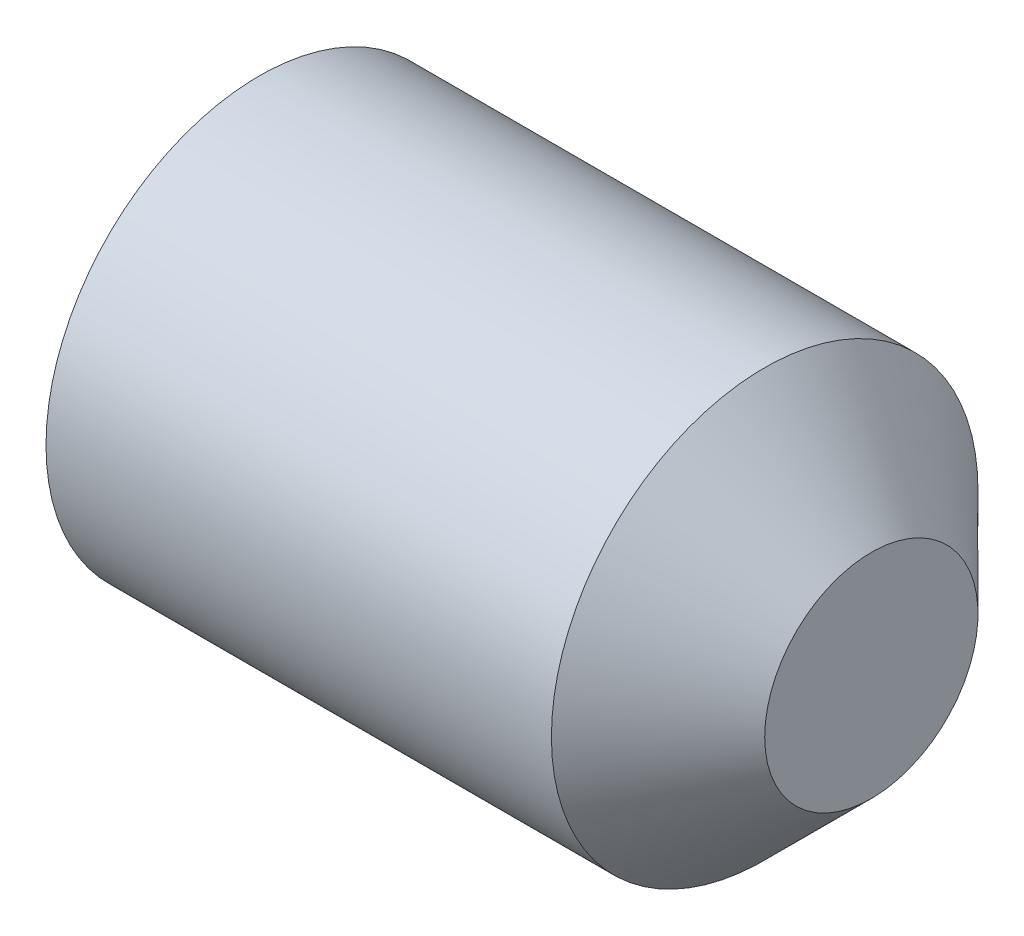
ISO-10303-21;
HEADER;
FILE_DESCRIPTION(('STEP AP214'),'2;1');
FILE_NAME('part.step','',(''),(''),'','','');
FILE_SCHEMA(('AUTOMOTIVE_DESIGN { 1 0 10303 214 1 1 1 1 }'));
ENDSEC;
DATA;
#1=APPLICATION_CONTEXT('core data for automotive mechanical design processes');
#2=APPLICATION_PROTOCOL_DEFINITION('international standard','automotive_design',2000,#1);
#3=PRODUCT_CONTEXT('',#1,'mechanical');
#4=PRODUCT('Part','Part','',(#3));
#5=PRODUCT_RELATED_PRODUCT_CATEGORY('part','',(#4));
#6=PRODUCT_DEFINITION_FORMATION('','',#4);
#7=PRODUCT_DEFINITION_CONTEXT('part definition',#1,'design');
#8=PRODUCT_DEFINITION('design','',#6,#7);
#9=PRODUCT_DEFINITION_SHAPE('','',#8);
#10=(LENGTH_UNIT() NAMED_UNIT(*) SI_UNIT(.MILLI.,.METRE.));
#11=(NAMED_UNIT(*) PLANE_ANGLE_UNIT() SI_UNIT($,.RADIAN.));
#12=(NAMED_UNIT(*) SI_UNIT($,.STERADIAN.) SOLID_ANGLE_UNIT());
#13=UNCERTAINTY_MEASURE_WITH_UNIT(LENGTH_MEASURE(1.E-05),#10,'distance_accuracy_value','');
#14=(GEOMETRIC_REPRESENTATION_CONTEXT(3) GLOBAL_UNCERTAINTY_ASSIGNED_CONTEXT((#13)) GLOBAL_UNIT_ASSIGNED_CONTEXT((#10,
#11,#12)) REPRESENTATION_CONTEXT('',''));
#15=CARTESIAN_POINT('',(0.,0.,0.));
#16=DIRECTION('',(0.,0.,1.));
#17=DIRECTION('',(1.,0.,0.));
#18=AXIS2_PLACEMENT_3D('',#15,#16,#17);
#19=CARTESIAN_POINT('',(0.,0.,0.));
#20=DIRECTION('',(-1.,0.,0.));
#21=DIRECTION('',(0.,0.,1.));
#22=AXIS2_PLACEMENT_3D('',#19,#20,#21);
#23=PLANE('',#22);
#24=CARTESIAN_POINT('',(0.,0.,0.));
#25=DIRECTION('',(-1.,0.,0.));
#26=DIRECTION('',(0.,0.,1.));
#27=AXIS2_PLACEMENT_3D('',#24,#25,#26);
#28=CIRCLE('',#27,0.774000000000001);
#29=CARTESIAN_POINT('',(0.,0.,0.774000000000001));
#30=VERTEX_POINT('',#29);
#31=EDGE_CURVE('E138',#30,#30,#28,.T.);
#32=ORIENTED_EDGE('',*,*,#31,.T.);
#33=EDGE_LOOP('',(#32));
#34=FACE_BOUND('',#33,.T.);
#35=DIRECTION('',(0.,0.,-1.));
#36=VECTOR('',#35,1.);
#37=CARTESIAN_POINT('',(0.,0.450000000000003,0.25980762113533));
#38=LINE('',#37,#36);
#39=CARTESIAN_POINT('',(0.,0.450000000000003,0.25980762113533));
#40=VERTEX_POINT('',#39);
#41=CARTESIAN_POINT('',(0.,0.450000000000003,-0.259807621135334));
#42=VERTEX_POINT('',#41);
#43=EDGE_CURVE('E129',#40,#42,#38,.T.);
#44=ORIENTED_EDGE('',*,*,#43,.F.);
#45=DIRECTION('',(0.,-0.866025403784439,0.5));
#46=VECTOR('',#45,1.);
#47=CARTESIAN_POINT('',(0.,0.450000000000003,0.25980762113533));
#48=LINE('',#47,#46);
#49=CARTESIAN_POINT('',(0.,0.,0.519615242270661));
#50=VERTEX_POINT('',#49);
#51=EDGE_CURVE('E51',#40,#50,#48,.T.);
#52=ORIENTED_EDGE('',*,*,#51,.T.);
#53=DIRECTION('',(0.,0.866025403784439,0.5));
#54=VECTOR('',#53,1.);
#55=CARTESIAN_POINT('',(0.,-0.449999999999997,0.259807621135329));
#56=LINE('',#55,#54);
#57=CARTESIAN_POINT('',(0.,-0.449999999999997,0.259807621135329));
#58=VERTEX_POINT('',#57);
#59=EDGE_CURVE('E120',#58,#50,#56,.T.);
#60=ORIENTED_EDGE('',*,*,#59,.F.);
#61=DIRECTION('',(0.,0.,-1.));
#62=VECTOR('',#61,1.);
#63=CARTESIAN_POINT('',(0.,-0.449999999999997,0.259807621135329));
#64=LINE('',#63,#62);
#65=CARTESIAN_POINT('',(0.,-0.449999999999997,-0.259807621135334));
#66=VERTEX_POINT('',#65);
#67=EDGE_CURVE('E123',#58,#66,#64,.T.);
#68=ORIENTED_EDGE('',*,*,#67,.T.);
#69=DIRECTION('',(0.,0.866025403784439,-0.5));
#70=VECTOR('',#69,1.);
#71=CARTESIAN_POINT('',(0.,-0.449999999999997,-0.259807621135334));
#72=LINE('',#71,#70);
#73=CARTESIAN_POINT('',(0.,0.,-0.519615242270665));
#74=VERTEX_POINT('',#73);
#75=EDGE_CURVE('E126',#66,#74,#72,.T.);
#76=ORIENTED_EDGE('',*,*,#75,.T.);
#77=DIRECTION('',(0.,-0.866025403784438,-0.5));
#78=VECTOR('',#77,1.);
#79=CARTESIAN_POINT('',(0.,0.450000000000003,-0.259807621135334));
#80=LINE('',#79,#78);
#81=EDGE_CURVE('E109',#42,#74,#80,.T.);
#82=ORIENTED_EDGE('',*,*,#81,.F.);
#83=EDGE_LOOP('',(#44,#52,#60,#68,#76,#82));
#84=FACE_BOUND('',#83,.T.);
#85=ADVANCED_FACE('F36',(#34,#84),#23,.T.);
#86=CARTESIAN_POINT('',(3.,0.5,0.));
#87=DIRECTION('',(1.,0.,0.));
#88=DIRECTION('',(0.,0.,-1.));
#89=AXIS2_PLACEMENT_3D('',#86,#87,#88);
#90=PLANE('',#89);
#91=CARTESIAN_POINT('',(3.,0.,0.));
#92=DIRECTION('',(-1.,0.,0.));
#93=DIRECTION('',(0.,0.,1.));
#94=AXIS2_PLACEMENT_3D('',#91,#92,#93);
#95=CIRCLE('',#94,0.5);
#96=CARTESIAN_POINT('',(3.,0.,0.5));
#97=VERTEX_POINT('',#96);
#98=EDGE_CURVE('E11',#97,#97,#95,.T.);
#99=ORIENTED_EDGE('',*,*,#98,.F.);
#100=EDGE_LOOP('',(#99));
#101=FACE_BOUND('',#100,.T.);
#102=ADVANCED_FACE('F38',(#101),#90,.T.);
#103=CARTESIAN_POINT('',(2.50000000000001,0.,0.));
#104=DIRECTION('',(-1.,0.,0.));
#105=DIRECTION('',(0.,0.,1.));
#106=AXIS2_PLACEMENT_3D('',#103,#104,#105);
#107=CONICAL_SURFACE('',#106,1.,0.785398163397455);
#108=ORIENTED_EDGE('',*,*,#98,.T.);
#109=EDGE_LOOP('',(#108));
#110=FACE_BOUND('',#109,.T.);
#111=CARTESIAN_POINT('',(2.50000000000001,0.,0.));
#112=DIRECTION('',(-1.,0.,0.));
#113=DIRECTION('',(0.,0.,1.));
#114=AXIS2_PLACEMENT_3D('',#111,#112,#113);
#115=CIRCLE('',#114,1.);
#116=CARTESIAN_POINT('',(2.50000000000001,0.,1.));
#117=VERTEX_POINT('',#116);
#118=EDGE_CURVE('E44',#117,#117,#115,.T.);
#119=ORIENTED_EDGE('',*,*,#118,.F.);
#120=EDGE_LOOP('',(#119));
#121=FACE_BOUND('',#120,.T.);
#122=ADVANCED_FACE('F149',(#110,#121),#107,.T.);
#123=CARTESIAN_POINT('',(-12.7,0.,0.));
#124=DIRECTION('',(-1.,0.,0.));
#125=DIRECTION('',(0.,0.,1.));
#126=AXIS2_PLACEMENT_3D('',#123,#124,#125);
#127=CYLINDRICAL_SURFACE('',#126,1.);
#128=ORIENTED_EDGE('',*,*,#118,.T.);
#129=EDGE_LOOP('',(#128));
#130=FACE_BOUND('',#129,.T.);
#131=CARTESIAN_POINT('',(0.130481160836854,0.,0.));
#132=DIRECTION('',(-1.,0.,0.));
#133=DIRECTION('',(0.,0.,1.));
#134=AXIS2_PLACEMENT_3D('',#131,#132,#133);
#135=CIRCLE('',#134,1.);
#136=CARTESIAN_POINT('',(0.130481160836854,0.,1.));
#137=VERTEX_POINT('',#136);
#138=EDGE_CURVE('E141',#137,#137,#135,.T.);
#139=ORIENTED_EDGE('',*,*,#138,.F.);
#140=EDGE_LOOP('',(#139));
#141=FACE_BOUND('',#140,.T.);
#142=ADVANCED_FACE('F146',(#130,#141),#127,.T.);
#143=CARTESIAN_POINT('',(0.,0.,0.));
#144=DIRECTION('',(1.,0.,0.));
#145=DIRECTION('',(0.,0.,-1.));
#146=AXIS2_PLACEMENT_3D('',#143,#144,#145);
#147=CONICAL_SURFACE('',#146,0.774000000000001,1.0471975511966);
#148=ORIENTED_EDGE('',*,*,#138,.T.);
#149=EDGE_LOOP('',(#148));
#150=FACE_BOUND('',#149,.T.);
#151=ORIENTED_EDGE('',*,*,#31,.F.);
#152=EDGE_LOOP('',(#151));
#153=FACE_BOUND('',#152,.T.);
#154=ADVANCED_FACE('F156',(#150,#153),#147,.T.);
#155=CARTESIAN_POINT('',(0.8,0.450000000000003,0.25980762113533));
#156=DIRECTION('',(0.,-0.5,-0.866025403784439));
#157=DIRECTION('',(0.,0.866025403784439,-0.5));
#158=AXIS2_PLACEMENT_3D('',#155,#156,#157);
#159=PLANE('',#158);
#160=ORIENTED_EDGE('',*,*,#51,.F.);
#161=DIRECTION('',(-1.,0.,0.));
#162=VECTOR('',#161,1.);
#163=CARTESIAN_POINT('',(0.8,0.450000000000003,0.25980762113533));
#164=LINE('',#163,#162);
#165=CARTESIAN_POINT('',(0.8,0.450000000000003,0.25980762113533));
#166=VERTEX_POINT('',#165);
#167=EDGE_CURVE('E56',#166,#40,#164,.T.);
#168=ORIENTED_EDGE('',*,*,#167,.F.);
#169=DIRECTION('',(0.,-0.866025403784439,0.5));
#170=VECTOR('',#169,1.);
#171=CARTESIAN_POINT('',(0.8,0.450000000000003,0.25980762113533));
#172=LINE('',#171,#170);
#173=CARTESIAN_POINT('',(0.8,0.,0.519615242270661));
#174=VERTEX_POINT('',#173);
#175=EDGE_CURVE('E83',#166,#174,#172,.T.);
#176=ORIENTED_EDGE('',*,*,#175,.T.);
#177=DIRECTION('',(-1.,0.,0.));
#178=VECTOR('',#177,1.);
#179=CARTESIAN_POINT('',(0.8,0.,0.519615242270661));
#180=LINE('',#179,#178);
#181=EDGE_CURVE('E136',#174,#50,#180,.T.);
#182=ORIENTED_EDGE('',*,*,#181,.T.);
#183=EDGE_LOOP('',(#160,#168,#176,#182));
#184=FACE_BOUND('',#183,.T.);
#185=ADVANCED_FACE('F167',(#184),#159,.T.);
#186=CARTESIAN_POINT('',(0.8,-0.449999999999997,0.259807621135329));
#187=DIRECTION('',(0.,-0.5,0.866025403784439));
#188=DIRECTION('',(0.,-0.866025403784439,-0.5));
#189=AXIS2_PLACEMENT_3D('',#186,#187,#188);
#190=PLANE('',#189);
#191=ORIENTED_EDGE('',*,*,#59,.T.);
#192=ORIENTED_EDGE('',*,*,#181,.F.);
#193=DIRECTION('',(0.,0.866025403784439,0.5));
#194=VECTOR('',#193,1.);
#195=CARTESIAN_POINT('',(0.8,-0.449999999999997,0.259807621135329));
#196=LINE('',#195,#194);
#197=CARTESIAN_POINT('',(0.8,-0.449999999999997,0.259807621135329));
#198=VERTEX_POINT('',#197);
#199=EDGE_CURVE('E267',#198,#174,#196,.T.);
#200=ORIENTED_EDGE('',*,*,#199,.F.);
#201=DIRECTION('',(-1.,0.,0.));
#202=VECTOR('',#201,1.);
#203=CARTESIAN_POINT('',(0.8,-0.449999999999997,0.259807621135329));
#204=LINE('',#203,#202);
#205=EDGE_CURVE('E134',#198,#58,#204,.T.);
#206=ORIENTED_EDGE('',*,*,#205,.T.);
#207=EDGE_LOOP('',(#191,#192,#200,#206));
#208=FACE_BOUND('',#207,.T.);
#209=ADVANCED_FACE('F174',(#208),#190,.F.);
#210=CARTESIAN_POINT('',(0.8,-0.449999999999997,0.259807621135329));
#211=DIRECTION('',(0.,1.,0.));
#212=DIRECTION('',(0.,0.,1.));
#213=AXIS2_PLACEMENT_3D('',#210,#211,#212);
#214=PLANE('',#213);
#215=ORIENTED_EDGE('',*,*,#67,.F.);
#216=ORIENTED_EDGE('',*,*,#205,.F.);
#217=DIRECTION('',(0.,0.,-1.));
#218=VECTOR('',#217,1.);
#219=CARTESIAN_POINT('',(0.8,-0.449999999999997,0.259807621135329));
#220=LINE('',#219,#218);
#221=CARTESIAN_POINT('',(0.8,-0.449999999999997,-0.259807621135334));
#222=VERTEX_POINT('',#221);
#223=EDGE_CURVE('E104',#198,#222,#220,.T.);
#224=ORIENTED_EDGE('',*,*,#223,.T.);
#225=DIRECTION('',(-1.,0.,0.));
#226=VECTOR('',#225,1.);
#227=CARTESIAN_POINT('',(0.8,-0.449999999999997,-0.259807621135334));
#228=LINE('',#227,#226);
#229=EDGE_CURVE('E99',#222,#66,#228,.T.);
#230=ORIENTED_EDGE('',*,*,#229,.T.);
#231=EDGE_LOOP('',(#215,#216,#224,#230));
#232=FACE_BOUND('',#231,.T.);
#233=ADVANCED_FACE('F181',(#232),#214,.T.);
#234=CARTESIAN_POINT('',(0.8,-0.449999999999997,-0.259807621135334));
#235=DIRECTION('',(0.,0.5,0.866025403784439));
#236=DIRECTION('',(0.,-0.866025403784439,0.5));
#237=AXIS2_PLACEMENT_3D('',#234,#235,#236);
#238=PLANE('',#237);
#239=ORIENTED_EDGE('',*,*,#75,.F.);
#240=ORIENTED_EDGE('',*,*,#229,.F.);
#241=DIRECTION('',(0.,0.866025403784439,-0.5));
#242=VECTOR('',#241,1.);
#243=CARTESIAN_POINT('',(0.8,-0.449999999999997,-0.259807621135334));
#244=LINE('',#243,#242);
#245=CARTESIAN_POINT('',(0.8,0.,-0.519615242270665));
#246=VERTEX_POINT('',#245);
#247=EDGE_CURVE('E94',#222,#246,#244,.T.);
#248=ORIENTED_EDGE('',*,*,#247,.T.);
#249=DIRECTION('',(-1.,0.,0.));
#250=VECTOR('',#249,1.);
#251=CARTESIAN_POINT('',(0.8,0.,-0.519615242270665));
#252=LINE('',#251,#250);
#253=EDGE_CURVE('E98',#246,#74,#252,.T.);
#254=ORIENTED_EDGE('',*,*,#253,.T.);
#255=EDGE_LOOP('',(#239,#240,#248,#254));
#256=FACE_BOUND('',#255,.T.);
#257=ADVANCED_FACE('F97',(#256),#238,.T.);
#258=CARTESIAN_POINT('',(0.8,0.450000000000003,-0.259807621135334));
#259=DIRECTION('',(0.,0.5,-0.866025403784438));
#260=DIRECTION('',(0.,0.866025403784439,0.5));
#261=AXIS2_PLACEMENT_3D('',#258,#259,#260);
#262=PLANE('',#261);
#263=ORIENTED_EDGE('',*,*,#81,.T.);
#264=ORIENTED_EDGE('',*,*,#253,.F.);
#265=DIRECTION('',(0.,-0.866025403784438,-0.5));
#266=VECTOR('',#265,1.);
#267=CARTESIAN_POINT('',(0.8,0.450000000000003,-0.259807621135334));
#268=LINE('',#267,#266);
#269=CARTESIAN_POINT('',(0.8,0.450000000000003,-0.259807621135334));
#270=VERTEX_POINT('',#269);
#271=EDGE_CURVE('E103',#270,#246,#268,.T.);
#272=ORIENTED_EDGE('',*,*,#271,.F.);
#273=DIRECTION('',(-1.,0.,0.));
#274=VECTOR('',#273,1.);
#275=CARTESIAN_POINT('',(0.8,0.450000000000003,-0.259807621135334));
#276=LINE('',#275,#274);
#277=EDGE_CURVE('E79',#270,#42,#276,.T.);
#278=ORIENTED_EDGE('',*,*,#277,.T.);
#279=EDGE_LOOP('',(#263,#264,#272,#278));
#280=FACE_BOUND('',#279,.T.);
#281=ADVANCED_FACE('F106',(#280),#262,.F.);
#282=CARTESIAN_POINT('',(0.8,0.450000000000003,0.25980762113533));
#283=DIRECTION('',(0.,1.,0.));
#284=DIRECTION('',(0.,0.,1.));
#285=AXIS2_PLACEMENT_3D('',#282,#283,#284);
#286=PLANE('',#285);
#287=ORIENTED_EDGE('',*,*,#43,.T.);
#288=ORIENTED_EDGE('',*,*,#277,.F.);
#289=DIRECTION('',(0.,0.,-1.));
#290=VECTOR('',#289,1.);
#291=CARTESIAN_POINT('',(0.8,0.450000000000003,0.25980762113533));
#292=LINE('',#291,#290);
#293=EDGE_CURVE('E114',#166,#270,#292,.T.);
#294=ORIENTED_EDGE('',*,*,#293,.F.);
#295=ORIENTED_EDGE('',*,*,#167,.T.);
#296=EDGE_LOOP('',(#287,#288,#294,#295));
#297=FACE_BOUND('',#296,.T.);
#298=ADVANCED_FACE('F193',(#297),#286,.F.);
#299=CARTESIAN_POINT('',(0.8,0.450000000000003,0.25980762113533));
#300=DIRECTION('',(1.,0.,0.));
#301=DIRECTION('',(0.,0.,-1.));
#302=AXIS2_PLACEMENT_3D('',#299,#300,#301);
#303=PLANE('',#302);
#304=ORIENTED_EDGE('',*,*,#175,.F.);
#305=ORIENTED_EDGE('',*,*,#293,.T.);
#306=ORIENTED_EDGE('',*,*,#271,.T.);
#307=ORIENTED_EDGE('',*,*,#247,.F.);
#308=ORIENTED_EDGE('',*,*,#223,.F.);
#309=ORIENTED_EDGE('',*,*,#199,.T.);
#310=EDGE_LOOP('',(#304,#305,#306,#307,#308,#309));
#311=FACE_BOUND('',#310,.T.);
#312=ADVANCED_FACE('F112',(#311),#303,.F.);
#313=CLOSED_SHELL('',(#85,#102,#122,#142,#154,#185,#209,#233,#257,#281,#298,#312));
#314=MANIFOLD_SOLID_BREP('B2',#313);
#315=ADVANCED_BREP_SHAPE_REPRESENTATION('',(#18,#314),#14);
#316=SHAPE_DEFINITION_REPRESENTATION(#9,#315);
ENDSEC;
END-ISO-10303-21;
